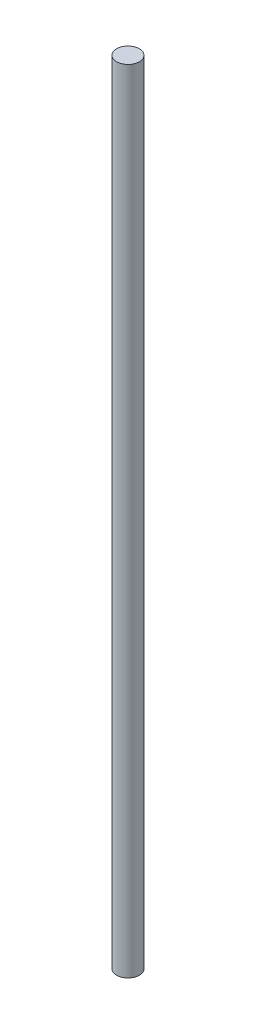
ISO-10303-21;
HEADER;
FILE_DESCRIPTION(('STEP AP214'),'2;1');
FILE_NAME('part.step','',(''),(''),'','','');
FILE_SCHEMA(('AUTOMOTIVE_DESIGN { 1 0 10303 214 1 1 1 1 }'));
ENDSEC;
DATA;
#1=APPLICATION_CONTEXT('core data for automotive mechanical design processes');
#2=APPLICATION_PROTOCOL_DEFINITION('international standard','automotive_design',2000,#1);
#3=PRODUCT_CONTEXT('',#1,'mechanical');
#4=PRODUCT('Part','Part','',(#3));
#5=PRODUCT_RELATED_PRODUCT_CATEGORY('part','',(#4));
#6=PRODUCT_DEFINITION_FORMATION('','',#4);
#7=PRODUCT_DEFINITION_CONTEXT('part definition',#1,'design');
#8=PRODUCT_DEFINITION('design','',#6,#7);
#9=PRODUCT_DEFINITION_SHAPE('','',#8);
#10=(LENGTH_UNIT() NAMED_UNIT(*) SI_UNIT(.MILLI.,.METRE.));
#11=(NAMED_UNIT(*) PLANE_ANGLE_UNIT() SI_UNIT($,.RADIAN.));
#12=(NAMED_UNIT(*) SI_UNIT($,.STERADIAN.) SOLID_ANGLE_UNIT());
#13=UNCERTAINTY_MEASURE_WITH_UNIT(LENGTH_MEASURE(1.E-05),#10,'distance_accuracy_value','');
#14=(GEOMETRIC_REPRESENTATION_CONTEXT(3) GLOBAL_UNCERTAINTY_ASSIGNED_CONTEXT((#13)) GLOBAL_UNIT_ASSIGNED_CONTEXT((#10,
#11,#12)) REPRESENTATION_CONTEXT('',''));
#15=CARTESIAN_POINT('',(0.,0.,0.));
#16=DIRECTION('',(0.,0.,1.));
#17=DIRECTION('',(1.,0.,0.));
#18=AXIS2_PLACEMENT_3D('',#15,#16,#17);
#19=CARTESIAN_POINT('',(0.,140.,0.));
#20=DIRECTION('',(0.,-1.,0.));
#21=DIRECTION('',(0.,0.,-1.));
#22=AXIS2_PLACEMENT_3D('',#19,#20,#21);
#23=CYLINDRICAL_SURFACE('',#22,2.);
#24=CARTESIAN_POINT('',(0.,140.,0.));
#25=DIRECTION('',(0.,1.,0.));
#26=DIRECTION('',(0.,0.,1.));
#27=AXIS2_PLACEMENT_3D('',#24,#25,#26);
#28=CIRCLE('',#27,2.);
#29=CARTESIAN_POINT('',(0.,140.,2.));
#30=VERTEX_POINT('',#29);
#31=EDGE_CURVE('E10',#30,#30,#28,.T.);
#32=ORIENTED_EDGE('',*,*,#31,.F.);
#33=EDGE_LOOP('',(#32));
#34=FACE_BOUND('',#33,.T.);
#35=CARTESIAN_POINT('',(0.,0.,0.));
#36=DIRECTION('',(0.,1.,0.));
#37=DIRECTION('',(0.,0.,1.));
#38=AXIS2_PLACEMENT_3D('',#35,#36,#37);
#39=CIRCLE('',#38,2.);
#40=CARTESIAN_POINT('',(0.,0.,2.));
#41=VERTEX_POINT('',#40);
#42=EDGE_CURVE('E34',#41,#41,#39,.T.);
#43=ORIENTED_EDGE('',*,*,#42,.T.);
#44=EDGE_LOOP('',(#43));
#45=FACE_BOUND('',#44,.T.);
#46=ADVANCED_FACE('F31',(#34,#45),#23,.T.);
#47=CARTESIAN_POINT('',(0.,140.,0.));
#48=DIRECTION('',(0.,1.,0.));
#49=DIRECTION('',(0.,0.,1.));
#50=AXIS2_PLACEMENT_3D('',#47,#48,#49);
#51=PLANE('',#50);
#52=ORIENTED_EDGE('',*,*,#31,.T.);
#53=EDGE_LOOP('',(#52));
#54=FACE_BOUND('',#53,.T.);
#55=ADVANCED_FACE('F46',(#54),#51,.T.);
#56=CARTESIAN_POINT('',(0.,0.,0.));
#57=DIRECTION('',(0.,1.,0.));
#58=DIRECTION('',(0.,0.,1.));
#59=AXIS2_PLACEMENT_3D('',#56,#57,#58);
#60=PLANE('',#59);
#61=ORIENTED_EDGE('',*,*,#42,.F.);
#62=EDGE_LOOP('',(#61));
#63=FACE_BOUND('',#62,.T.);
#64=ADVANCED_FACE('F44',(#63),#60,.F.);
#65=CLOSED_SHELL('',(#46,#55,#64));
#66=MANIFOLD_SOLID_BREP('B2',#65);
#67=ADVANCED_BREP_SHAPE_REPRESENTATION('',(#18,#66),#14);
#68=SHAPE_DEFINITION_REPRESENTATION(#9,#67);
ENDSEC;
END-ISO-10303-21;
